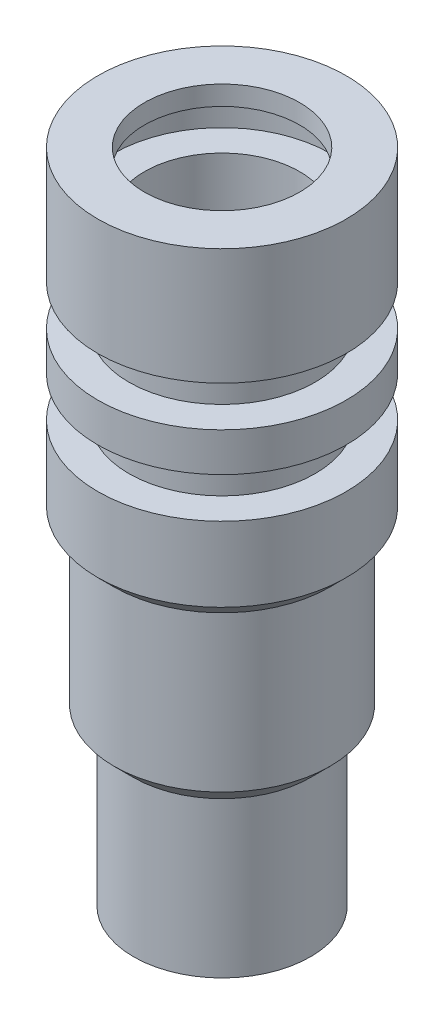
ISO-10303-21;
HEADER;
FILE_DESCRIPTION(('STEP AP214'),'2;1');
FILE_NAME('part.step','',(''),(''),'','','');
FILE_SCHEMA(('AUTOMOTIVE_DESIGN { 1 0 10303 214 1 1 1 1 }'));
ENDSEC;
DATA;
#1=APPLICATION_CONTEXT('core data for automotive mechanical design processes');
#2=APPLICATION_PROTOCOL_DEFINITION('international standard','automotive_design',2000,#1);
#3=PRODUCT_CONTEXT('',#1,'mechanical');
#4=PRODUCT('Part','Part','',(#3));
#5=PRODUCT_RELATED_PRODUCT_CATEGORY('part','',(#4));
#6=PRODUCT_DEFINITION_FORMATION('','',#4);
#7=PRODUCT_DEFINITION_CONTEXT('part definition',#1,'design');
#8=PRODUCT_DEFINITION('design','',#6,#7);
#9=PRODUCT_DEFINITION_SHAPE('','',#8);
#10=(LENGTH_UNIT() NAMED_UNIT(*) SI_UNIT(.MILLI.,.METRE.));
#11=(NAMED_UNIT(*) PLANE_ANGLE_UNIT() SI_UNIT($,.RADIAN.));
#12=(NAMED_UNIT(*) SI_UNIT($,.STERADIAN.) SOLID_ANGLE_UNIT());
#13=UNCERTAINTY_MEASURE_WITH_UNIT(LENGTH_MEASURE(1.E-05),#10,'distance_accuracy_value','');
#14=(GEOMETRIC_REPRESENTATION_CONTEXT(3) GLOBAL_UNCERTAINTY_ASSIGNED_CONTEXT((#13)) GLOBAL_UNIT_ASSIGNED_CONTEXT((#10,
#11,#12)) REPRESENTATION_CONTEXT('',''));
#15=CARTESIAN_POINT('',(0.,0.,0.));
#16=DIRECTION('',(0.,0.,1.));
#17=DIRECTION('',(1.,0.,0.));
#18=AXIS2_PLACEMENT_3D('',#15,#16,#17);
#19=CARTESIAN_POINT('',(0.,0.,0.));
#20=DIRECTION('',(0.,1.,0.));
#21=DIRECTION('',(0.,0.,1.));
#22=AXIS2_PLACEMENT_3D('',#19,#20,#21);
#23=CYLINDRICAL_SURFACE('',#22,6.34999999999998);
#24=CARTESIAN_POINT('',(0.,0.,0.));
#25=DIRECTION('',(0.,1.,0.));
#26=DIRECTION('',(0.,0.,1.));
#27=AXIS2_PLACEMENT_3D('',#24,#25,#26);
#28=CIRCLE('',#27,6.34999999999998);
#29=CARTESIAN_POINT('',(0.,0.,6.34999999999998));
#30=VERTEX_POINT('',#29);
#31=EDGE_CURVE('E120',#30,#30,#28,.T.);
#32=ORIENTED_EDGE('',*,*,#31,.T.);
#33=EDGE_LOOP('',(#32));
#34=FACE_BOUND('',#33,.T.);
#35=CARTESIAN_POINT('',(0.,-1.5875,0.));
#36=DIRECTION('',(0.,1.,0.));
#37=DIRECTION('',(0.,0.,1.));
#38=AXIS2_PLACEMENT_3D('',#35,#36,#37);
#39=CIRCLE('',#38,6.34999999999998);
#40=CARTESIAN_POINT('',(0.,-1.5875,6.34999999999998));
#41=VERTEX_POINT('',#40);
#42=EDGE_CURVE('E10',#41,#41,#39,.T.);
#43=ORIENTED_EDGE('',*,*,#42,.F.);
#44=EDGE_LOOP('',(#43));
#45=FACE_BOUND('',#44,.T.);
#46=ADVANCED_FACE('F37',(#34,#45),#23,.F.);
#47=CARTESIAN_POINT('',(-6.34999999999998,-1.5875,0.));
#48=DIRECTION('',(0.,-1.,0.));
#49=DIRECTION('',(0.,0.,-1.));
#50=AXIS2_PLACEMENT_3D('',#47,#48,#49);
#51=PLANE('',#50);
#52=ORIENTED_EDGE('',*,*,#42,.T.);
#53=EDGE_LOOP('',(#52));
#54=FACE_BOUND('',#53,.T.);
#55=CARTESIAN_POINT('',(0.,-1.5875,0.));
#56=DIRECTION('',(0.,1.,0.));
#57=DIRECTION('',(0.,0.,1.));
#58=AXIS2_PLACEMENT_3D('',#55,#56,#57);
#59=CIRCLE('',#58,8.88999999999998);
#60=CARTESIAN_POINT('',(0.,-1.5875,8.88999999999998));
#61=VERTEX_POINT('',#60);
#62=EDGE_CURVE('E44',#61,#61,#59,.T.);
#63=ORIENTED_EDGE('',*,*,#62,.F.);
#64=EDGE_LOOP('',(#63));
#65=FACE_BOUND('',#64,.T.);
#66=ADVANCED_FACE('F139',(#54,#65),#51,.T.);
#67=CARTESIAN_POINT('',(0.,0.,0.));
#68=DIRECTION('',(0.,1.,0.));
#69=DIRECTION('',(0.,0.,1.));
#70=AXIS2_PLACEMENT_3D('',#67,#68,#69);
#71=CYLINDRICAL_SURFACE('',#70,8.88999999999998);
#72=ORIENTED_EDGE('',*,*,#62,.T.);
#73=EDGE_LOOP('',(#72));
#74=FACE_BOUND('',#73,.T.);
#75=CARTESIAN_POINT('',(0.,-4.8895,0.));
#76=DIRECTION('',(0.,1.,0.));
#77=DIRECTION('',(0.,0.,1.));
#78=AXIS2_PLACEMENT_3D('',#75,#76,#77);
#79=CIRCLE('',#78,8.88999999999998);
#80=CARTESIAN_POINT('',(0.,-4.8895,8.88999999999998));
#81=VERTEX_POINT('',#80);
#82=EDGE_CURVE('E49',#81,#81,#79,.T.);
#83=ORIENTED_EDGE('',*,*,#82,.F.);
#84=EDGE_LOOP('',(#83));
#85=FACE_BOUND('',#84,.T.);
#86=ADVANCED_FACE('F143',(#74,#85),#71,.F.);
#87=CARTESIAN_POINT('',(-8.88999999999998,-4.8895,0.));
#88=DIRECTION('',(0.,1.,0.));
#89=DIRECTION('',(0.,0.,1.));
#90=AXIS2_PLACEMENT_3D('',#87,#88,#89);
#91=PLANE('',#90);
#92=ORIENTED_EDGE('',*,*,#82,.T.);
#93=EDGE_LOOP('',(#92));
#94=FACE_BOUND('',#93,.T.);
#95=CARTESIAN_POINT('',(0.,-4.8895,0.));
#96=DIRECTION('',(0.,1.,0.));
#97=DIRECTION('',(0.,0.,1.));
#98=AXIS2_PLACEMENT_3D('',#95,#96,#97);
#99=CIRCLE('',#98,6.34999999999999);
#100=CARTESIAN_POINT('',(0.,-4.8895,6.34999999999999));
#101=VERTEX_POINT('',#100);
#102=EDGE_CURVE('E54',#101,#101,#99,.T.);
#103=ORIENTED_EDGE('',*,*,#102,.F.);
#104=EDGE_LOOP('',(#103));
#105=FACE_BOUND('',#104,.T.);
#106=ADVANCED_FACE('F147',(#94,#105),#91,.T.);
#107=CARTESIAN_POINT('',(0.,0.,0.));
#108=DIRECTION('',(0.,1.,0.));
#109=DIRECTION('',(0.,0.,1.));
#110=AXIS2_PLACEMENT_3D('',#107,#108,#109);
#111=CYLINDRICAL_SURFACE('',#110,6.34999999999999);
#112=ORIENTED_EDGE('',*,*,#102,.T.);
#113=EDGE_LOOP('',(#112));
#114=FACE_BOUND('',#113,.T.);
#115=CARTESIAN_POINT('',(0.,-53.7209999999999,0.));
#116=DIRECTION('',(0.,1.,0.));
#117=DIRECTION('',(0.,0.,1.));
#118=AXIS2_PLACEMENT_3D('',#115,#116,#117);
#119=CIRCLE('',#118,6.34999999999999);
#120=CARTESIAN_POINT('',(0.,-53.7209999999999,6.34999999999999));
#121=VERTEX_POINT('',#120);
#122=EDGE_CURVE('E60',#121,#121,#119,.T.);
#123=ORIENTED_EDGE('',*,*,#122,.F.);
#124=EDGE_LOOP('',(#123));
#125=FACE_BOUND('',#124,.T.);
#126=ADVANCED_FACE('F153',(#114,#125),#111,.F.);
#127=CARTESIAN_POINT('',(-7.23899999999999,-53.7209999999999,0.));
#128=DIRECTION('',(0.,-1.,0.));
#129=DIRECTION('',(0.,0.,-1.));
#130=AXIS2_PLACEMENT_3D('',#127,#128,#129);
#131=PLANE('',#130);
#132=ORIENTED_EDGE('',*,*,#122,.T.);
#133=EDGE_LOOP('',(#132));
#134=FACE_BOUND('',#133,.T.);
#135=CARTESIAN_POINT('',(0.,-53.7209999999999,0.));
#136=DIRECTION('',(0.,1.,0.));
#137=DIRECTION('',(0.,0.,1.));
#138=AXIS2_PLACEMENT_3D('',#135,#136,#137);
#139=CIRCLE('',#138,7.23899999999999);
#140=CARTESIAN_POINT('',(0.,-53.7209999999999,7.23899999999999));
#141=VERTEX_POINT('',#140);
#142=EDGE_CURVE('E64',#141,#141,#139,.T.);
#143=ORIENTED_EDGE('',*,*,#142,.F.);
#144=EDGE_LOOP('',(#143));
#145=FACE_BOUND('',#144,.T.);
#146=ADVANCED_FACE('F157',(#134,#145),#131,.T.);
#147=CARTESIAN_POINT('',(0.,0.,0.));
#148=DIRECTION('',(0.,1.,0.));
#149=DIRECTION('',(0.,0.,1.));
#150=AXIS2_PLACEMENT_3D('',#147,#148,#149);
#151=CYLINDRICAL_SURFACE('',#150,7.23899999999999);
#152=ORIENTED_EDGE('',*,*,#142,.T.);
#153=EDGE_LOOP('',(#152));
#154=FACE_BOUND('',#153,.T.);
#155=CARTESIAN_POINT('',(0.,-41.0209999999999,0.));
#156=DIRECTION('',(0.,1.,0.));
#157=DIRECTION('',(0.,0.,1.));
#158=AXIS2_PLACEMENT_3D('',#155,#156,#157);
#159=CIRCLE('',#158,7.23899999999999);
#160=CARTESIAN_POINT('',(0.,-41.0209999999999,7.23899999999999));
#161=VERTEX_POINT('',#160);
#162=EDGE_CURVE('E68',#161,#161,#159,.T.);
#163=ORIENTED_EDGE('',*,*,#162,.F.);
#164=EDGE_LOOP('',(#163));
#165=FACE_BOUND('',#164,.T.);
#166=ADVANCED_FACE('F161',(#154,#165),#151,.T.);
#167=CARTESIAN_POINT('',(0.,-39.4335,0.));
#168=DIRECTION('',(0.,1.,0.));
#169=DIRECTION('',(0.,0.,1.));
#170=AXIS2_PLACEMENT_3D('',#167,#168,#169);
#171=CONICAL_SURFACE('',#170,8.82649999999999,0.785398163397467);
#172=ORIENTED_EDGE('',*,*,#162,.T.);
#173=EDGE_LOOP('',(#172));
#174=FACE_BOUND('',#173,.T.);
#175=CARTESIAN_POINT('',(0.,-39.4335,0.));
#176=DIRECTION('',(0.,1.,0.));
#177=DIRECTION('',(0.,0.,1.));
#178=AXIS2_PLACEMENT_3D('',#175,#176,#177);
#179=CIRCLE('',#178,8.82649999999999);
#180=CARTESIAN_POINT('',(0.,-39.4335,8.82649999999999));
#181=VERTEX_POINT('',#180);
#182=EDGE_CURVE('E72',#181,#181,#179,.T.);
#183=ORIENTED_EDGE('',*,*,#182,.F.);
#184=EDGE_LOOP('',(#183));
#185=FACE_BOUND('',#184,.T.);
#186=ADVANCED_FACE('F165',(#174,#185),#171,.T.);
#187=CARTESIAN_POINT('',(0.,0.,0.));
#188=DIRECTION('',(0.,1.,0.));
#189=DIRECTION('',(0.,0.,1.));
#190=AXIS2_PLACEMENT_3D('',#187,#188,#189);
#191=CYLINDRICAL_SURFACE('',#190,8.82649999999999);
#192=ORIENTED_EDGE('',*,*,#182,.T.);
#193=EDGE_LOOP('',(#192));
#194=FACE_BOUND('',#193,.T.);
#195=CARTESIAN_POINT('',(0.,-26.7335,0.));
#196=DIRECTION('',(0.,1.,0.));
#197=DIRECTION('',(0.,0.,1.));
#198=AXIS2_PLACEMENT_3D('',#195,#196,#197);
#199=CIRCLE('',#198,8.82649999999999);
#200=CARTESIAN_POINT('',(0.,-26.7335,8.82649999999999));
#201=VERTEX_POINT('',#200);
#202=EDGE_CURVE('E76',#201,#201,#199,.T.);
#203=ORIENTED_EDGE('',*,*,#202,.F.);
#204=EDGE_LOOP('',(#203));
#205=FACE_BOUND('',#204,.T.);
#206=ADVANCED_FACE('F169',(#194,#205),#191,.T.);
#207=CARTESIAN_POINT('',(0.,-25.4,0.));
#208=DIRECTION('',(0.,1.,0.));
#209=DIRECTION('',(0.,0.,1.));
#210=AXIS2_PLACEMENT_3D('',#207,#208,#209);
#211=CONICAL_SURFACE('',#210,10.16,0.785398163397466);
#212=ORIENTED_EDGE('',*,*,#202,.T.);
#213=EDGE_LOOP('',(#212));
#214=FACE_BOUND('',#213,.T.);
#215=CARTESIAN_POINT('',(0.,-25.4,0.));
#216=DIRECTION('',(0.,1.,0.));
#217=DIRECTION('',(0.,0.,1.));
#218=AXIS2_PLACEMENT_3D('',#215,#216,#217);
#219=CIRCLE('',#218,10.16);
#220=CARTESIAN_POINT('',(0.,-25.4,10.16));
#221=VERTEX_POINT('',#220);
#222=EDGE_CURVE('E80',#221,#221,#219,.T.);
#223=ORIENTED_EDGE('',*,*,#222,.F.);
#224=EDGE_LOOP('',(#223));
#225=FACE_BOUND('',#224,.T.);
#226=ADVANCED_FACE('F173',(#214,#225),#211,.T.);
#227=CARTESIAN_POINT('',(0.,0.,0.));
#228=DIRECTION('',(0.,1.,0.));
#229=DIRECTION('',(0.,0.,1.));
#230=AXIS2_PLACEMENT_3D('',#227,#228,#229);
#231=CYLINDRICAL_SURFACE('',#230,10.16);
#232=ORIENTED_EDGE('',*,*,#222,.T.);
#233=EDGE_LOOP('',(#232));
#234=FACE_BOUND('',#233,.T.);
#235=CARTESIAN_POINT('',(0.,-19.304,0.));
#236=DIRECTION('',(0.,1.,0.));
#237=DIRECTION('',(0.,0.,1.));
#238=AXIS2_PLACEMENT_3D('',#235,#236,#237);
#239=CIRCLE('',#238,10.16);
#240=CARTESIAN_POINT('',(0.,-19.304,10.16));
#241=VERTEX_POINT('',#240);
#242=EDGE_CURVE('E84',#241,#241,#239,.T.);
#243=ORIENTED_EDGE('',*,*,#242,.F.);
#244=EDGE_LOOP('',(#243));
#245=FACE_BOUND('',#244,.T.);
#246=ADVANCED_FACE('F177',(#234,#245),#231,.T.);
#247=CARTESIAN_POINT('',(-7.61999999999999,-19.304,0.));
#248=DIRECTION('',(0.,1.,0.));
#249=DIRECTION('',(0.,0.,1.));
#250=AXIS2_PLACEMENT_3D('',#247,#248,#249);
#251=PLANE('',#250);
#252=ORIENTED_EDGE('',*,*,#242,.T.);
#253=EDGE_LOOP('',(#252));
#254=FACE_BOUND('',#253,.T.);
#255=CARTESIAN_POINT('',(0.,-19.304,0.));
#256=DIRECTION('',(0.,1.,0.));
#257=DIRECTION('',(0.,0.,1.));
#258=AXIS2_PLACEMENT_3D('',#255,#256,#257);
#259=CIRCLE('',#258,7.61999999999999);
#260=CARTESIAN_POINT('',(0.,-19.304,7.61999999999999));
#261=VERTEX_POINT('',#260);
#262=EDGE_CURVE('E88',#261,#261,#259,.T.);
#263=ORIENTED_EDGE('',*,*,#262,.F.);
#264=EDGE_LOOP('',(#263));
#265=FACE_BOUND('',#264,.T.);
#266=ADVANCED_FACE('F181',(#254,#265),#251,.T.);
#267=CARTESIAN_POINT('',(0.,0.,0.));
#268=DIRECTION('',(0.,1.,0.));
#269=DIRECTION('',(0.,0.,1.));
#270=AXIS2_PLACEMENT_3D('',#267,#268,#269);
#271=CYLINDRICAL_SURFACE('',#270,7.61999999999999);
#272=ORIENTED_EDGE('',*,*,#262,.T.);
#273=EDGE_LOOP('',(#272));
#274=FACE_BOUND('',#273,.T.);
#275=CARTESIAN_POINT('',(0.,-16.002,0.));
#276=DIRECTION('',(0.,1.,0.));
#277=DIRECTION('',(0.,0.,1.));
#278=AXIS2_PLACEMENT_3D('',#275,#276,#277);
#279=CIRCLE('',#278,7.61999999999999);
#280=CARTESIAN_POINT('',(0.,-16.002,7.61999999999999));
#281=VERTEX_POINT('',#280);
#282=EDGE_CURVE('E92',#281,#281,#279,.T.);
#283=ORIENTED_EDGE('',*,*,#282,.F.);
#284=EDGE_LOOP('',(#283));
#285=FACE_BOUND('',#284,.T.);
#286=ADVANCED_FACE('F185',(#274,#285),#271,.T.);
#287=CARTESIAN_POINT('',(-10.16,-16.002,0.));
#288=DIRECTION('',(0.,-1.,0.));
#289=DIRECTION('',(0.,0.,-1.));
#290=AXIS2_PLACEMENT_3D('',#287,#288,#289);
#291=PLANE('',#290);
#292=ORIENTED_EDGE('',*,*,#282,.T.);
#293=EDGE_LOOP('',(#292));
#294=FACE_BOUND('',#293,.T.);
#295=CARTESIAN_POINT('',(0.,-16.002,0.));
#296=DIRECTION('',(0.,1.,0.));
#297=DIRECTION('',(0.,0.,1.));
#298=AXIS2_PLACEMENT_3D('',#295,#296,#297);
#299=CIRCLE('',#298,10.16);
#300=CARTESIAN_POINT('',(0.,-16.002,10.16));
#301=VERTEX_POINT('',#300);
#302=EDGE_CURVE('E96',#301,#301,#299,.T.);
#303=ORIENTED_EDGE('',*,*,#302,.F.);
#304=EDGE_LOOP('',(#303));
#305=FACE_BOUND('',#304,.T.);
#306=ADVANCED_FACE('F189',(#294,#305),#291,.T.);
#307=CARTESIAN_POINT('',(0.,0.,0.));
#308=DIRECTION('',(0.,1.,0.));
#309=DIRECTION('',(0.,0.,1.));
#310=AXIS2_PLACEMENT_3D('',#307,#308,#309);
#311=CYLINDRICAL_SURFACE('',#310,10.16);
#312=ORIENTED_EDGE('',*,*,#302,.T.);
#313=EDGE_LOOP('',(#312));
#314=FACE_BOUND('',#313,.T.);
#315=CARTESIAN_POINT('',(0.,-12.827,0.));
#316=DIRECTION('',(0.,1.,0.));
#317=DIRECTION('',(0.,0.,1.));
#318=AXIS2_PLACEMENT_3D('',#315,#316,#317);
#319=CIRCLE('',#318,10.16);
#320=CARTESIAN_POINT('',(0.,-12.827,10.16));
#321=VERTEX_POINT('',#320);
#322=EDGE_CURVE('E100',#321,#321,#319,.T.);
#323=ORIENTED_EDGE('',*,*,#322,.F.);
#324=EDGE_LOOP('',(#323));
#325=FACE_BOUND('',#324,.T.);
#326=ADVANCED_FACE('F193',(#314,#325),#311,.T.);
#327=CARTESIAN_POINT('',(-7.61999999999999,-12.827,0.));
#328=DIRECTION('',(0.,1.,0.));
#329=DIRECTION('',(0.,0.,1.));
#330=AXIS2_PLACEMENT_3D('',#327,#328,#329);
#331=PLANE('',#330);
#332=ORIENTED_EDGE('',*,*,#322,.T.);
#333=EDGE_LOOP('',(#332));
#334=FACE_BOUND('',#333,.T.);
#335=CARTESIAN_POINT('',(0.,-12.827,0.));
#336=DIRECTION('',(0.,1.,0.));
#337=DIRECTION('',(0.,0.,1.));
#338=AXIS2_PLACEMENT_3D('',#335,#336,#337);
#339=CIRCLE('',#338,7.61999999999999);
#340=CARTESIAN_POINT('',(0.,-12.827,7.61999999999999));
#341=VERTEX_POINT('',#340);
#342=EDGE_CURVE('E104',#341,#341,#339,.T.);
#343=ORIENTED_EDGE('',*,*,#342,.F.);
#344=EDGE_LOOP('',(#343));
#345=FACE_BOUND('',#344,.T.);
#346=ADVANCED_FACE('F197',(#334,#345),#331,.T.);
#347=CARTESIAN_POINT('',(0.,0.,0.));
#348=DIRECTION('',(0.,1.,0.));
#349=DIRECTION('',(0.,0.,1.));
#350=AXIS2_PLACEMENT_3D('',#347,#348,#349);
#351=CYLINDRICAL_SURFACE('',#350,7.61999999999999);
#352=ORIENTED_EDGE('',*,*,#342,.T.);
#353=EDGE_LOOP('',(#352));
#354=FACE_BOUND('',#353,.T.);
#355=CARTESIAN_POINT('',(0.,-9.525,0.));
#356=DIRECTION('',(0.,1.,0.));
#357=DIRECTION('',(0.,0.,1.));
#358=AXIS2_PLACEMENT_3D('',#355,#356,#357);
#359=CIRCLE('',#358,7.61999999999999);
#360=CARTESIAN_POINT('',(0.,-9.525,7.61999999999999));
#361=VERTEX_POINT('',#360);
#362=EDGE_CURVE('E108',#361,#361,#359,.T.);
#363=ORIENTED_EDGE('',*,*,#362,.F.);
#364=EDGE_LOOP('',(#363));
#365=FACE_BOUND('',#364,.T.);
#366=ADVANCED_FACE('F201',(#354,#365),#351,.T.);
#367=CARTESIAN_POINT('',(-10.16,-9.525,0.));
#368=DIRECTION('',(0.,-1.,0.));
#369=DIRECTION('',(0.,0.,-1.));
#370=AXIS2_PLACEMENT_3D('',#367,#368,#369);
#371=PLANE('',#370);
#372=ORIENTED_EDGE('',*,*,#362,.T.);
#373=EDGE_LOOP('',(#372));
#374=FACE_BOUND('',#373,.T.);
#375=CARTESIAN_POINT('',(0.,-9.525,0.));
#376=DIRECTION('',(0.,1.,0.));
#377=DIRECTION('',(0.,0.,1.));
#378=AXIS2_PLACEMENT_3D('',#375,#376,#377);
#379=CIRCLE('',#378,10.16);
#380=CARTESIAN_POINT('',(0.,-9.525,10.16));
#381=VERTEX_POINT('',#380);
#382=EDGE_CURVE('E112',#381,#381,#379,.T.);
#383=ORIENTED_EDGE('',*,*,#382,.F.);
#384=EDGE_LOOP('',(#383));
#385=FACE_BOUND('',#384,.T.);
#386=ADVANCED_FACE('F135',(#374,#385),#371,.T.);
#387=CARTESIAN_POINT('',(0.,0.,0.));
#388=DIRECTION('',(0.,1.,0.));
#389=DIRECTION('',(0.,0.,1.));
#390=AXIS2_PLACEMENT_3D('',#387,#388,#389);
#391=CYLINDRICAL_SURFACE('',#390,10.16);
#392=ORIENTED_EDGE('',*,*,#382,.T.);
#393=EDGE_LOOP('',(#392));
#394=FACE_BOUND('',#393,.T.);
#395=CARTESIAN_POINT('',(0.,0.,0.));
#396=DIRECTION('',(0.,1.,0.));
#397=DIRECTION('',(0.,0.,1.));
#398=AXIS2_PLACEMENT_3D('',#395,#396,#397);
#399=CIRCLE('',#398,10.16);
#400=CARTESIAN_POINT('',(0.,0.,10.16));
#401=VERTEX_POINT('',#400);
#402=EDGE_CURVE('E116',#401,#401,#399,.T.);
#403=ORIENTED_EDGE('',*,*,#402,.F.);
#404=EDGE_LOOP('',(#403));
#405=FACE_BOUND('',#404,.T.);
#406=ADVANCED_FACE('F129',(#394,#405),#391,.T.);
#407=CARTESIAN_POINT('',(-6.34999999999998,0.,0.));
#408=DIRECTION('',(0.,1.,0.));
#409=DIRECTION('',(0.,0.,1.));
#410=AXIS2_PLACEMENT_3D('',#407,#408,#409);
#411=PLANE('',#410);
#412=ORIENTED_EDGE('',*,*,#402,.T.);
#413=EDGE_LOOP('',(#412));
#414=FACE_BOUND('',#413,.T.);
#415=ORIENTED_EDGE('',*,*,#31,.F.);
#416=EDGE_LOOP('',(#415));
#417=FACE_BOUND('',#416,.T.);
#418=ADVANCED_FACE('F127',(#414,#417),#411,.T.);
#419=CLOSED_SHELL('',(#46,#66,#86,#106,#126,#146,#166,#186,#206,#226,#246,#266,#286,#306,#326,
#346,#366,#386,#406,#418));
#420=MANIFOLD_SOLID_BREP('B2',#419);
#421=ADVANCED_BREP_SHAPE_REPRESENTATION('',(#18,#420),#14);
#422=SHAPE_DEFINITION_REPRESENTATION(#9,#421);
ENDSEC;
END-ISO-10303-21;
